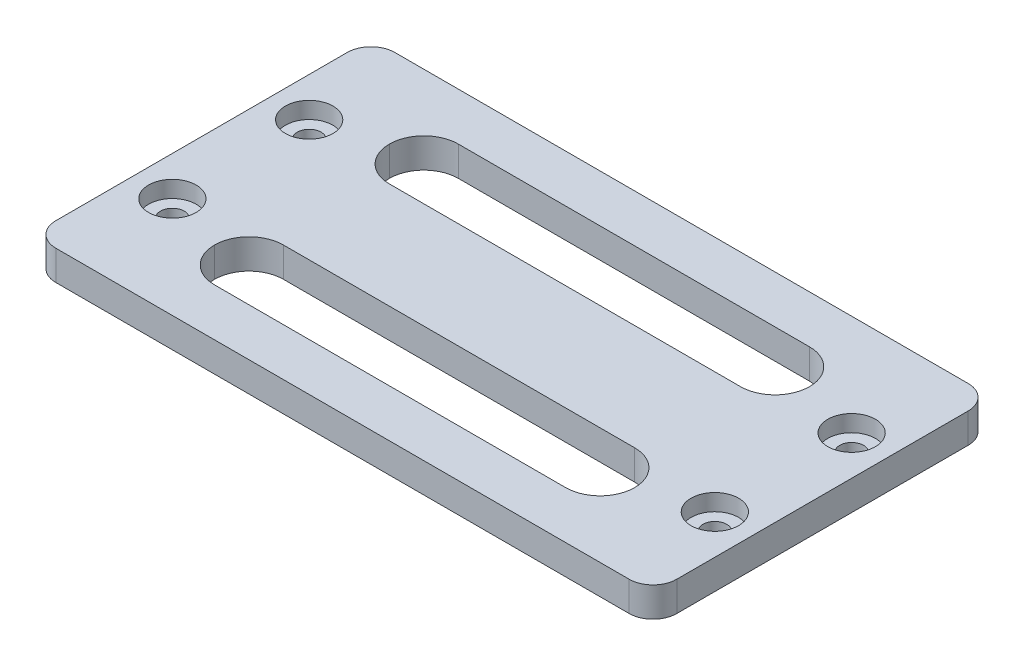
ISO-10303-21;
HEADER;
FILE_DESCRIPTION(('STEP AP214'),'2;1');
FILE_NAME('part.step','',(''),(''),'','','');
FILE_SCHEMA(('AUTOMOTIVE_DESIGN { 1 0 10303 214 1 1 1 1 }'));
ENDSEC;
DATA;
#1=APPLICATION_CONTEXT('core data for automotive mechanical design processes');
#2=APPLICATION_PROTOCOL_DEFINITION('international standard','automotive_design',2000,#1);
#3=PRODUCT_CONTEXT('',#1,'mechanical');
#4=PRODUCT('Part','Part','',(#3));
#5=PRODUCT_RELATED_PRODUCT_CATEGORY('part','',(#4));
#6=PRODUCT_DEFINITION_FORMATION('','',#4);
#7=PRODUCT_DEFINITION_CONTEXT('part definition',#1,'design');
#8=PRODUCT_DEFINITION('design','',#6,#7);
#9=PRODUCT_DEFINITION_SHAPE('','',#8);
#10=(LENGTH_UNIT() NAMED_UNIT(*) SI_UNIT(.MILLI.,.METRE.));
#11=(NAMED_UNIT(*) PLANE_ANGLE_UNIT() SI_UNIT($,.RADIAN.));
#12=(NAMED_UNIT(*) SI_UNIT($,.STERADIAN.) SOLID_ANGLE_UNIT());
#13=UNCERTAINTY_MEASURE_WITH_UNIT(LENGTH_MEASURE(1.E-05),#10,'distance_accuracy_value','');
#14=(GEOMETRIC_REPRESENTATION_CONTEXT(3) GLOBAL_UNCERTAINTY_ASSIGNED_CONTEXT((#13)) GLOBAL_UNIT_ASSIGNED_CONTEXT((#10,
#11,#12)) REPRESENTATION_CONTEXT('',''));
#15=CARTESIAN_POINT('',(0.,0.,0.));
#16=DIRECTION('',(0.,0.,1.));
#17=DIRECTION('',(1.,0.,0.));
#18=AXIS2_PLACEMENT_3D('',#15,#16,#17);
#19=CARTESIAN_POINT('',(22.8,2.5,-8.3));
#20=DIRECTION('',(0.,-1.,0.));
#21=DIRECTION('',(0.,0.,-1.));
#22=AXIS2_PLACEMENT_3D('',#19,#20,#21);
#23=CYLINDRICAL_SURFACE('',#22,1.);
#24=CARTESIAN_POINT('',(22.8,0.,-8.3));
#25=DIRECTION('',(0.,1.,0.));
#26=DIRECTION('',(0.,0.,1.));
#27=AXIS2_PLACEMENT_3D('',#24,#25,#26);
#28=CIRCLE('',#27,1.);
#29=CARTESIAN_POINT('',(22.8,0.,-7.29999999999999));
#30=VERTEX_POINT('',#29);
#31=EDGE_CURVE('E361',#30,#30,#28,.T.);
#32=ORIENTED_EDGE('',*,*,#31,.F.);
#33=EDGE_LOOP('',(#32));
#34=FACE_BOUND('',#33,.T.);
#35=CARTESIAN_POINT('',(22.8,1.1,-8.3));
#36=DIRECTION('',(0.,1.,0.));
#37=DIRECTION('',(0.,0.,1.));
#38=AXIS2_PLACEMENT_3D('',#35,#36,#37);
#39=CIRCLE('',#38,1.);
#40=CARTESIAN_POINT('',(22.8,1.1,-7.29999999999999));
#41=VERTEX_POINT('',#40);
#42=EDGE_CURVE('E41',#41,#41,#39,.T.);
#43=ORIENTED_EDGE('',*,*,#42,.T.);
#44=EDGE_LOOP('',(#43));
#45=FACE_BOUND('',#44,.T.);
#46=ADVANCED_FACE('F37',(#34,#45),#23,.F.);
#47=CARTESIAN_POINT('',(22.8,2.5,3.2));
#48=DIRECTION('',(0.,-1.,0.));
#49=DIRECTION('',(0.,0.,-1.));
#50=AXIS2_PLACEMENT_3D('',#47,#48,#49);
#51=CYLINDRICAL_SURFACE('',#50,1.);
#52=CARTESIAN_POINT('',(22.8,0.,3.2));
#53=DIRECTION('',(0.,1.,0.));
#54=DIRECTION('',(0.,0.,-1.));
#55=AXIS2_PLACEMENT_3D('',#52,#53,#54);
#56=CIRCLE('',#55,1.);
#57=CARTESIAN_POINT('',(22.8,0.,2.19999999999999));
#58=VERTEX_POINT('',#57);
#59=EDGE_CURVE('E364',#58,#58,#56,.T.);
#60=ORIENTED_EDGE('',*,*,#59,.F.);
#61=EDGE_LOOP('',(#60));
#62=FACE_BOUND('',#61,.T.);
#63=CARTESIAN_POINT('',(22.8,1.1,3.2));
#64=DIRECTION('',(0.,1.,0.));
#65=DIRECTION('',(0.,0.,1.));
#66=AXIS2_PLACEMENT_3D('',#63,#64,#65);
#67=CIRCLE('',#66,1.);
#68=CARTESIAN_POINT('',(22.8,1.1,4.2));
#69=VERTEX_POINT('',#68);
#70=EDGE_CURVE('E311',#69,#69,#67,.T.);
#71=ORIENTED_EDGE('',*,*,#70,.T.);
#72=EDGE_LOOP('',(#71));
#73=FACE_BOUND('',#72,.T.);
#74=ADVANCED_FACE('F415',(#62,#73),#51,.F.);
#75=CARTESIAN_POINT('',(-22.8,2.5,3.2));
#76=DIRECTION('',(0.,-1.,0.));
#77=DIRECTION('',(0.,0.,-1.));
#78=AXIS2_PLACEMENT_3D('',#75,#76,#77);
#79=CYLINDRICAL_SURFACE('',#78,1.);
#80=CARTESIAN_POINT('',(-22.8,0.,3.2));
#81=DIRECTION('',(0.,1.,0.));
#82=DIRECTION('',(0.,0.,1.));
#83=AXIS2_PLACEMENT_3D('',#80,#81,#82);
#84=CIRCLE('',#83,1.);
#85=CARTESIAN_POINT('',(-22.8,0.,4.2));
#86=VERTEX_POINT('',#85);
#87=EDGE_CURVE('E208',#86,#86,#84,.T.);
#88=ORIENTED_EDGE('',*,*,#87,.F.);
#89=EDGE_LOOP('',(#88));
#90=FACE_BOUND('',#89,.T.);
#91=CARTESIAN_POINT('',(-22.8,1.1,3.2));
#92=DIRECTION('',(0.,1.,0.));
#93=DIRECTION('',(0.,0.,1.));
#94=AXIS2_PLACEMENT_3D('',#91,#92,#93);
#95=CIRCLE('',#94,1.);
#96=CARTESIAN_POINT('',(-22.8,1.1,4.2));
#97=VERTEX_POINT('',#96);
#98=EDGE_CURVE('E307',#97,#97,#95,.T.);
#99=ORIENTED_EDGE('',*,*,#98,.T.);
#100=EDGE_LOOP('',(#99));
#101=FACE_BOUND('',#100,.T.);
#102=ADVANCED_FACE('F421',(#90,#101),#79,.F.);
#103=CARTESIAN_POINT('',(-22.8,2.5,-8.29999999999999));
#104=DIRECTION('',(0.,-1.,0.));
#105=DIRECTION('',(0.,0.,-1.));
#106=AXIS2_PLACEMENT_3D('',#103,#104,#105);
#107=CYLINDRICAL_SURFACE('',#106,1.);
#108=CARTESIAN_POINT('',(-22.8,0.,-8.29999999999999));
#109=DIRECTION('',(0.,1.,0.));
#110=DIRECTION('',(0.,0.,-1.));
#111=AXIS2_PLACEMENT_3D('',#108,#109,#110);
#112=CIRCLE('',#111,1.);
#113=CARTESIAN_POINT('',(-22.8,0.,-9.29999999999999));
#114=VERTEX_POINT('',#113);
#115=EDGE_CURVE('E355',#114,#114,#112,.T.);
#116=ORIENTED_EDGE('',*,*,#115,.F.);
#117=EDGE_LOOP('',(#116));
#118=FACE_BOUND('',#117,.T.);
#119=CARTESIAN_POINT('',(-22.8,1.1,-8.29999999999999));
#120=DIRECTION('',(0.,1.,0.));
#121=DIRECTION('',(0.,0.,1.));
#122=AXIS2_PLACEMENT_3D('',#119,#120,#121);
#123=CIRCLE('',#122,1.);
#124=CARTESIAN_POINT('',(-22.8,1.1,-7.29999999999999));
#125=VERTEX_POINT('',#124);
#126=EDGE_CURVE('E303',#125,#125,#123,.T.);
#127=ORIENTED_EDGE('',*,*,#126,.T.);
#128=EDGE_LOOP('',(#127));
#129=FACE_BOUND('',#128,.T.);
#130=ADVANCED_FACE('F427',(#118,#129),#107,.F.);
#131=CARTESIAN_POINT('',(0.,2.5,0.));
#132=DIRECTION('',(0.,-1.,0.));
#133=DIRECTION('',(0.,0.,-1.));
#134=AXIS2_PLACEMENT_3D('',#131,#132,#133);
#135=PLANE('',#134);
#136=CARTESIAN_POINT('',(22.8,2.5,-8.3));
#137=DIRECTION('',(0.,1.,0.));
#138=DIRECTION('',(0.,0.,1.));
#139=AXIS2_PLACEMENT_3D('',#136,#137,#138);
#140=CIRCLE('',#139,2.);
#141=CARTESIAN_POINT('',(22.8,2.5,-6.29999999999999));
#142=VERTEX_POINT('',#141);
#143=EDGE_CURVE('E327',#142,#142,#140,.T.);
#144=ORIENTED_EDGE('',*,*,#143,.F.);
#145=EDGE_LOOP('',(#144));
#146=FACE_BOUND('',#145,.T.);
#147=CARTESIAN_POINT('',(22.8,2.5,3.2));
#148=DIRECTION('',(0.,1.,0.));
#149=DIRECTION('',(0.,0.,1.));
#150=AXIS2_PLACEMENT_3D('',#147,#148,#149);
#151=CIRCLE('',#150,2.);
#152=CARTESIAN_POINT('',(22.8,2.5,5.2));
#153=VERTEX_POINT('',#152);
#154=EDGE_CURVE('E320',#153,#153,#151,.T.);
#155=ORIENTED_EDGE('',*,*,#154,.F.);
#156=EDGE_LOOP('',(#155));
#157=FACE_BOUND('',#156,.T.);
#158=CARTESIAN_POINT('',(-22.8,2.5,3.2));
#159=DIRECTION('',(0.,1.,0.));
#160=DIRECTION('',(0.,0.,1.));
#161=AXIS2_PLACEMENT_3D('',#158,#159,#160);
#162=CIRCLE('',#161,2.);
#163=CARTESIAN_POINT('',(-22.8,2.5,5.2));
#164=VERTEX_POINT('',#163);
#165=EDGE_CURVE('E313',#164,#164,#162,.T.);
#166=ORIENTED_EDGE('',*,*,#165,.F.);
#167=EDGE_LOOP('',(#166));
#168=FACE_BOUND('',#167,.T.);
#169=CARTESIAN_POINT('',(-22.8,2.5,-8.29999999999999));
#170=DIRECTION('',(0.,1.,0.));
#171=DIRECTION('',(0.,0.,1.));
#172=AXIS2_PLACEMENT_3D('',#169,#170,#171);
#173=CIRCLE('',#172,2.);
#174=CARTESIAN_POINT('',(-22.8,2.5,-6.29999999999999));
#175=VERTEX_POINT('',#174);
#176=EDGE_CURVE('E309',#175,#175,#173,.T.);
#177=ORIENTED_EDGE('',*,*,#176,.F.);
#178=EDGE_LOOP('',(#177));
#179=FACE_BOUND('',#178,.T.);
#180=DIRECTION('',(-1.,0.,0.));
#181=VECTOR('',#180,1.);
#182=CARTESIAN_POINT('',(-17.6603184164153,2.5,-12.8));
#183=LINE('',#182,#181);
#184=CARTESIAN_POINT('',(14.7603184164153,2.5,-12.8));
#185=VERTEX_POINT('',#184);
#186=CARTESIAN_POINT('',(-14.7603184164153,2.5,-12.8));
#187=VERTEX_POINT('',#186);
#188=EDGE_CURVE('E348',#185,#187,#183,.T.);
#189=ORIENTED_EDGE('',*,*,#188,.F.);
#190=CARTESIAN_POINT('',(14.7603184164153,2.5,-9.90000000000001));
#191=DIRECTION('',(0.,-1.,0.));
#192=DIRECTION('',(0.,0.,-1.));
#193=AXIS2_PLACEMENT_3D('',#190,#191,#192);
#194=CIRCLE('',#193,2.9);
#195=CARTESIAN_POINT('',(17.6603184164153,2.5,-9.90000000000001));
#196=VERTEX_POINT('',#195);
#197=EDGE_CURVE('E268',#185,#196,#194,.T.);
#198=ORIENTED_EDGE('',*,*,#197,.T.);
#199=CARTESIAN_POINT('',(14.7603184164153,2.5,-9.90000000000001));
#200=DIRECTION('',(0.,-1.,0.));
#201=DIRECTION('',(0.,0.,-1.));
#202=AXIS2_PLACEMENT_3D('',#199,#200,#201);
#203=CIRCLE('',#202,2.9);
#204=CARTESIAN_POINT('',(14.7603184164153,2.5,-7.00000000000001));
#205=VERTEX_POINT('',#204);
#206=EDGE_CURVE('E264',#196,#205,#203,.T.);
#207=ORIENTED_EDGE('',*,*,#206,.T.);
#208=DIRECTION('',(1.,0.,0.));
#209=VECTOR('',#208,1.);
#210=CARTESIAN_POINT('',(-17.6603184164153,2.5,-7.00000000000001));
#211=LINE('',#210,#209);
#212=CARTESIAN_POINT('',(-14.7603184164153,2.5,-7.00000000000001));
#213=VERTEX_POINT('',#212);
#214=EDGE_CURVE('E351',#213,#205,#211,.T.);
#215=ORIENTED_EDGE('',*,*,#214,.F.);
#216=CARTESIAN_POINT('',(-14.7603184164153,2.5,-9.90000000000001));
#217=DIRECTION('',(0.,-1.,0.));
#218=DIRECTION('',(0.,0.,-1.));
#219=AXIS2_PLACEMENT_3D('',#216,#217,#218);
#220=CIRCLE('',#219,2.9);
#221=CARTESIAN_POINT('',(-17.6603184164153,2.5,-9.90000000000001));
#222=VERTEX_POINT('',#221);
#223=EDGE_CURVE('E53',#213,#222,#220,.T.);
#224=ORIENTED_EDGE('',*,*,#223,.T.);
#225=CARTESIAN_POINT('',(-14.7603184164153,2.5,-9.90000000000001));
#226=DIRECTION('',(0.,-1.,0.));
#227=DIRECTION('',(0.,0.,-1.));
#228=AXIS2_PLACEMENT_3D('',#225,#226,#227);
#229=CIRCLE('',#228,2.9);
#230=EDGE_CURVE('E11',#222,#187,#229,.T.);
#231=ORIENTED_EDGE('',*,*,#230,.T.);
#232=EDGE_LOOP('',(#189,#198,#207,#215,#224,#231));
#233=FACE_BOUND('',#232,.T.);
#234=DIRECTION('',(0.,0.,-1.));
#235=VECTOR('',#234,1.);
#236=CARTESIAN_POINT('',(26.1,2.5,11.7));
#237=LINE('',#236,#235);
#238=CARTESIAN_POINT('',(26.1,2.5,9.7));
#239=VERTEX_POINT('',#238);
#240=CARTESIAN_POINT('',(26.1,2.5,-14.8));
#241=VERTEX_POINT('',#240);
#242=EDGE_CURVE('E214',#239,#241,#237,.T.);
#243=ORIENTED_EDGE('',*,*,#242,.T.);
#244=CARTESIAN_POINT('',(24.1,2.5,-14.8));
#245=DIRECTION('',(0.,-1.,0.));
#246=DIRECTION('',(0.,0.,-1.));
#247=AXIS2_PLACEMENT_3D('',#244,#245,#246);
#248=CIRCLE('',#247,2.);
#249=CARTESIAN_POINT('',(24.1,2.5,-16.8));
#250=VERTEX_POINT('',#249);
#251=EDGE_CURVE('E230',#241,#250,#248,.F.);
#252=ORIENTED_EDGE('',*,*,#251,.T.);
#253=DIRECTION('',(-1.,0.,0.));
#254=VECTOR('',#253,1.);
#255=CARTESIAN_POINT('',(-26.1,2.5,-16.8));
#256=LINE('',#255,#254);
#257=CARTESIAN_POINT('',(-24.1,2.5,-16.8));
#258=VERTEX_POINT('',#257);
#259=EDGE_CURVE('E195',#250,#258,#256,.T.);
#260=ORIENTED_EDGE('',*,*,#259,.T.);
#261=CARTESIAN_POINT('',(-24.1,2.5,-14.8));
#262=DIRECTION('',(0.,-1.,0.));
#263=DIRECTION('',(0.,0.,-1.));
#264=AXIS2_PLACEMENT_3D('',#261,#262,#263);
#265=CIRCLE('',#264,2.);
#266=CARTESIAN_POINT('',(-26.1,2.5,-14.8));
#267=VERTEX_POINT('',#266);
#268=EDGE_CURVE('E224',#258,#267,#265,.F.);
#269=ORIENTED_EDGE('',*,*,#268,.T.);
#270=DIRECTION('',(0.,0.,1.));
#271=VECTOR('',#270,1.);
#272=CARTESIAN_POINT('',(-26.1,2.5,11.7));
#273=LINE('',#272,#271);
#274=CARTESIAN_POINT('',(-26.1,2.5,9.7));
#275=VERTEX_POINT('',#274);
#276=EDGE_CURVE('E372',#267,#275,#273,.T.);
#277=ORIENTED_EDGE('',*,*,#276,.T.);
#278=CARTESIAN_POINT('',(-24.1,2.5,9.7));
#279=DIRECTION('',(0.,-1.,0.));
#280=DIRECTION('',(0.,0.,-1.));
#281=AXIS2_PLACEMENT_3D('',#278,#279,#280);
#282=CIRCLE('',#281,2.);
#283=CARTESIAN_POINT('',(-24.1,2.5,11.7));
#284=VERTEX_POINT('',#283);
#285=EDGE_CURVE('E226',#275,#284,#282,.F.);
#286=ORIENTED_EDGE('',*,*,#285,.T.);
#287=DIRECTION('',(1.,0.,0.));
#288=VECTOR('',#287,1.);
#289=CARTESIAN_POINT('',(-26.1,2.5,11.7));
#290=LINE('',#289,#288);
#291=CARTESIAN_POINT('',(24.1,2.5,11.7));
#292=VERTEX_POINT('',#291);
#293=EDGE_CURVE('E215',#284,#292,#290,.T.);
#294=ORIENTED_EDGE('',*,*,#293,.T.);
#295=CARTESIAN_POINT('',(24.1,2.5,9.7));
#296=DIRECTION('',(0.,-1.,0.));
#297=DIRECTION('',(0.,0.,-1.));
#298=AXIS2_PLACEMENT_3D('',#295,#296,#297);
#299=CIRCLE('',#298,2.);
#300=EDGE_CURVE('E228',#292,#239,#299,.F.);
#301=ORIENTED_EDGE('',*,*,#300,.T.);
#302=EDGE_LOOP('',(#243,#252,#260,#269,#277,#286,#294,#301));
#303=FACE_BOUND('',#302,.T.);
#304=CARTESIAN_POINT('',(-14.7603184164153,2.5,4.80000000000001));
#305=DIRECTION('',(0.,-1.,0.));
#306=DIRECTION('',(0.,0.,-1.));
#307=AXIS2_PLACEMENT_3D('',#304,#305,#306);
#308=CIRCLE('',#307,2.9);
#309=CARTESIAN_POINT('',(-14.7603184164153,2.5,7.70000000000001));
#310=VERTEX_POINT('',#309);
#311=CARTESIAN_POINT('',(-17.6603184164153,2.5,4.80000000000001));
#312=VERTEX_POINT('',#311);
#313=EDGE_CURVE('E280',#310,#312,#308,.T.);
#314=ORIENTED_EDGE('',*,*,#313,.T.);
#315=CARTESIAN_POINT('',(-14.7603184164153,2.5,4.80000000000001));
#316=DIRECTION('',(0.,-1.,0.));
#317=DIRECTION('',(0.,0.,-1.));
#318=AXIS2_PLACEMENT_3D('',#315,#316,#317);
#319=CIRCLE('',#318,2.9);
#320=CARTESIAN_POINT('',(-14.7603184164153,2.5,1.90000000000001));
#321=VERTEX_POINT('',#320);
#322=EDGE_CURVE('E284',#312,#321,#319,.T.);
#323=ORIENTED_EDGE('',*,*,#322,.T.);
#324=DIRECTION('',(-1.,0.,0.));
#325=VECTOR('',#324,1.);
#326=CARTESIAN_POINT('',(-17.6603184164153,2.5,1.90000000000001));
#327=LINE('',#326,#325);
#328=CARTESIAN_POINT('',(14.7603184164153,2.5,1.90000000000001));
#329=VERTEX_POINT('',#328);
#330=EDGE_CURVE('E339',#329,#321,#327,.T.);
#331=ORIENTED_EDGE('',*,*,#330,.F.);
#332=CARTESIAN_POINT('',(14.7603184164153,2.5,4.80000000000001));
#333=DIRECTION('',(0.,-1.,0.));
#334=DIRECTION('',(0.,0.,-1.));
#335=AXIS2_PLACEMENT_3D('',#332,#333,#334);
#336=CIRCLE('',#335,2.9);
#337=CARTESIAN_POINT('',(17.6603184164153,2.5,4.80000000000001));
#338=VERTEX_POINT('',#337);
#339=EDGE_CURVE('E276',#329,#338,#336,.T.);
#340=ORIENTED_EDGE('',*,*,#339,.T.);
#341=CARTESIAN_POINT('',(14.7603184164153,2.5,4.80000000000001));
#342=DIRECTION('',(0.,-1.,0.));
#343=DIRECTION('',(0.,0.,-1.));
#344=AXIS2_PLACEMENT_3D('',#341,#342,#343);
#345=CIRCLE('',#344,2.9);
#346=CARTESIAN_POINT('',(14.7603184164153,2.5,7.70000000000001));
#347=VERTEX_POINT('',#346);
#348=EDGE_CURVE('E272',#338,#347,#345,.T.);
#349=ORIENTED_EDGE('',*,*,#348,.T.);
#350=DIRECTION('',(1.,0.,0.));
#351=VECTOR('',#350,1.);
#352=CARTESIAN_POINT('',(-17.6603184164153,2.5,7.70000000000001));
#353=LINE('',#352,#351);
#354=EDGE_CURVE('E336',#310,#347,#353,.T.);
#355=ORIENTED_EDGE('',*,*,#354,.F.);
#356=EDGE_LOOP('',(#314,#323,#331,#340,#349,#355));
#357=FACE_BOUND('',#356,.T.);
#358=ADVANCED_FACE('F378',(#146,#157,#168,#179,#233,#303,#357),#135,.F.);
#359=CARTESIAN_POINT('',(0.,0.,0.));
#360=DIRECTION('',(0.,-1.,0.));
#361=DIRECTION('',(0.,0.,-1.));
#362=AXIS2_PLACEMENT_3D('',#359,#360,#361);
#363=PLANE('',#362);
#364=DIRECTION('',(-1.,0.,0.));
#365=VECTOR('',#364,1.);
#366=CARTESIAN_POINT('',(-17.6603184164153,0.,-12.8));
#367=LINE('',#366,#365);
#368=CARTESIAN_POINT('',(14.7603184164153,0.,-12.8));
#369=VERTEX_POINT('',#368);
#370=CARTESIAN_POINT('',(-14.7603184164153,0.,-12.8));
#371=VERTEX_POINT('',#370);
#372=EDGE_CURVE('E343',#369,#371,#367,.T.);
#373=ORIENTED_EDGE('',*,*,#372,.T.);
#374=CARTESIAN_POINT('',(-14.7603184164153,0.,-9.90000000000001));
#375=DIRECTION('',(0.,-1.,0.));
#376=DIRECTION('',(0.,0.,-1.));
#377=AXIS2_PLACEMENT_3D('',#374,#375,#376);
#378=CIRCLE('',#377,2.9);
#379=CARTESIAN_POINT('',(-17.6603184164153,0.,-9.90000000000001));
#380=VERTEX_POINT('',#379);
#381=EDGE_CURVE('E46',#371,#380,#378,.F.);
#382=ORIENTED_EDGE('',*,*,#381,.T.);
#383=CARTESIAN_POINT('',(-14.7603184164153,0.,-9.90000000000001));
#384=DIRECTION('',(0.,-1.,0.));
#385=DIRECTION('',(0.,0.,-1.));
#386=AXIS2_PLACEMENT_3D('',#383,#384,#385);
#387=CIRCLE('',#386,2.9);
#388=CARTESIAN_POINT('',(-14.7603184164153,0.,-7.00000000000001));
#389=VERTEX_POINT('',#388);
#390=EDGE_CURVE('E286',#380,#389,#387,.F.);
#391=ORIENTED_EDGE('',*,*,#390,.T.);
#392=DIRECTION('',(1.,0.,0.));
#393=VECTOR('',#392,1.);
#394=CARTESIAN_POINT('',(-17.6603184164153,0.,-7.00000000000001));
#395=LINE('',#394,#393);
#396=CARTESIAN_POINT('',(14.7603184164153,0.,-7.00000000000001));
#397=VERTEX_POINT('',#396);
#398=EDGE_CURVE('E352',#389,#397,#395,.T.);
#399=ORIENTED_EDGE('',*,*,#398,.T.);
#400=CARTESIAN_POINT('',(14.7603184164153,0.,-9.90000000000001));
#401=DIRECTION('',(0.,-1.,0.));
#402=DIRECTION('',(0.,0.,-1.));
#403=AXIS2_PLACEMENT_3D('',#400,#401,#402);
#404=CIRCLE('',#403,2.9);
#405=CARTESIAN_POINT('',(17.6603184164153,0.,-9.90000000000001));
#406=VERTEX_POINT('',#405);
#407=EDGE_CURVE('E262',#397,#406,#404,.F.);
#408=ORIENTED_EDGE('',*,*,#407,.T.);
#409=CARTESIAN_POINT('',(14.7603184164153,0.,-9.90000000000001));
#410=DIRECTION('',(0.,-1.,0.));
#411=DIRECTION('',(0.,0.,-1.));
#412=AXIS2_PLACEMENT_3D('',#409,#410,#411);
#413=CIRCLE('',#412,2.9);
#414=EDGE_CURVE('E266',#406,#369,#413,.F.);
#415=ORIENTED_EDGE('',*,*,#414,.T.);
#416=EDGE_LOOP('',(#373,#382,#391,#399,#408,#415));
#417=FACE_BOUND('',#416,.T.);
#418=ORIENTED_EDGE('',*,*,#31,.T.);
#419=EDGE_LOOP('',(#418));
#420=FACE_BOUND('',#419,.T.);
#421=ORIENTED_EDGE('',*,*,#87,.T.);
#422=EDGE_LOOP('',(#421));
#423=FACE_BOUND('',#422,.T.);
#424=DIRECTION('',(-1.,0.,0.));
#425=VECTOR('',#424,1.);
#426=CARTESIAN_POINT('',(-26.1,0.,-16.8));
#427=LINE('',#426,#425);
#428=CARTESIAN_POINT('',(24.1,0.,-16.8));
#429=VERTEX_POINT('',#428);
#430=CARTESIAN_POINT('',(-24.1,0.,-16.8));
#431=VERTEX_POINT('',#430);
#432=EDGE_CURVE('E192',#429,#431,#427,.T.);
#433=ORIENTED_EDGE('',*,*,#432,.F.);
#434=CARTESIAN_POINT('',(24.1,0.,-14.8));
#435=DIRECTION('',(0.,-1.,0.));
#436=DIRECTION('',(0.,0.,-1.));
#437=AXIS2_PLACEMENT_3D('',#434,#435,#436);
#438=CIRCLE('',#437,2.);
#439=CARTESIAN_POINT('',(26.1,0.,-14.8));
#440=VERTEX_POINT('',#439);
#441=EDGE_CURVE('E175',#429,#440,#438,.T.);
#442=ORIENTED_EDGE('',*,*,#441,.T.);
#443=DIRECTION('',(0.,0.,-1.));
#444=VECTOR('',#443,1.);
#445=CARTESIAN_POINT('',(26.1,0.,11.7));
#446=LINE('',#445,#444);
#447=CARTESIAN_POINT('',(26.1,0.,9.7));
#448=VERTEX_POINT('',#447);
#449=EDGE_CURVE('E203',#448,#440,#446,.T.);
#450=ORIENTED_EDGE('',*,*,#449,.F.);
#451=CARTESIAN_POINT('',(24.1,0.,9.7));
#452=DIRECTION('',(0.,-1.,0.));
#453=DIRECTION('',(0.,0.,-1.));
#454=AXIS2_PLACEMENT_3D('',#451,#452,#453);
#455=CIRCLE('',#454,2.);
#456=CARTESIAN_POINT('',(24.1,0.,11.7));
#457=VERTEX_POINT('',#456);
#458=EDGE_CURVE('E186',#448,#457,#455,.T.);
#459=ORIENTED_EDGE('',*,*,#458,.T.);
#460=DIRECTION('',(1.,0.,0.));
#461=VECTOR('',#460,1.);
#462=CARTESIAN_POINT('',(-26.1,0.,11.7));
#463=LINE('',#462,#461);
#464=CARTESIAN_POINT('',(-24.1,0.,11.7));
#465=VERTEX_POINT('',#464);
#466=EDGE_CURVE('E206',#465,#457,#463,.T.);
#467=ORIENTED_EDGE('',*,*,#466,.F.);
#468=CARTESIAN_POINT('',(-24.1,0.,9.7));
#469=DIRECTION('',(0.,-1.,0.));
#470=DIRECTION('',(0.,0.,-1.));
#471=AXIS2_PLACEMENT_3D('',#468,#469,#470);
#472=CIRCLE('',#471,2.);
#473=CARTESIAN_POINT('',(-26.1,0.,9.7));
#474=VERTEX_POINT('',#473);
#475=EDGE_CURVE('E218',#465,#474,#472,.T.);
#476=ORIENTED_EDGE('',*,*,#475,.T.);
#477=DIRECTION('',(0.,0.,1.));
#478=VECTOR('',#477,1.);
#479=CARTESIAN_POINT('',(-26.1,0.,11.7));
#480=LINE('',#479,#478);
#481=CARTESIAN_POINT('',(-26.1,0.,-14.8));
#482=VERTEX_POINT('',#481);
#483=EDGE_CURVE('E202',#482,#474,#480,.T.);
#484=ORIENTED_EDGE('',*,*,#483,.F.);
#485=CARTESIAN_POINT('',(-24.1,0.,-14.8));
#486=DIRECTION('',(0.,-1.,0.));
#487=DIRECTION('',(0.,0.,-1.));
#488=AXIS2_PLACEMENT_3D('',#485,#486,#487);
#489=CIRCLE('',#488,2.);
#490=EDGE_CURVE('E196',#482,#431,#489,.T.);
#491=ORIENTED_EDGE('',*,*,#490,.T.);
#492=EDGE_LOOP('',(#433,#442,#450,#459,#467,#476,#484,#491));
#493=FACE_BOUND('',#492,.T.);
#494=ORIENTED_EDGE('',*,*,#59,.T.);
#495=EDGE_LOOP('',(#494));
#496=FACE_BOUND('',#495,.T.);
#497=ORIENTED_EDGE('',*,*,#115,.T.);
#498=EDGE_LOOP('',(#497));
#499=FACE_BOUND('',#498,.T.);
#500=CARTESIAN_POINT('',(14.7603184164153,0.,4.80000000000001));
#501=DIRECTION('',(0.,-1.,0.));
#502=DIRECTION('',(0.,0.,-1.));
#503=AXIS2_PLACEMENT_3D('',#500,#501,#502);
#504=CIRCLE('',#503,2.9);
#505=CARTESIAN_POINT('',(14.7603184164153,0.,7.70000000000001));
#506=VERTEX_POINT('',#505);
#507=CARTESIAN_POINT('',(17.6603184164153,0.,4.80000000000001));
#508=VERTEX_POINT('',#507);
#509=EDGE_CURVE('E270',#506,#508,#504,.F.);
#510=ORIENTED_EDGE('',*,*,#509,.T.);
#511=CARTESIAN_POINT('',(14.7603184164153,0.,4.80000000000001));
#512=DIRECTION('',(0.,-1.,0.));
#513=DIRECTION('',(0.,0.,-1.));
#514=AXIS2_PLACEMENT_3D('',#511,#512,#513);
#515=CIRCLE('',#514,2.9);
#516=CARTESIAN_POINT('',(14.7603184164153,0.,1.90000000000001));
#517=VERTEX_POINT('',#516);
#518=EDGE_CURVE('E274',#508,#517,#515,.F.);
#519=ORIENTED_EDGE('',*,*,#518,.T.);
#520=DIRECTION('',(-1.,0.,0.));
#521=VECTOR('',#520,1.);
#522=CARTESIAN_POINT('',(-17.6603184164153,0.,1.90000000000001));
#523=LINE('',#522,#521);
#524=CARTESIAN_POINT('',(-14.7603184164153,0.,1.90000000000001));
#525=VERTEX_POINT('',#524);
#526=EDGE_CURVE('E340',#517,#525,#523,.T.);
#527=ORIENTED_EDGE('',*,*,#526,.T.);
#528=CARTESIAN_POINT('',(-14.7603184164153,0.,4.80000000000001));
#529=DIRECTION('',(0.,-1.,0.));
#530=DIRECTION('',(0.,0.,-1.));
#531=AXIS2_PLACEMENT_3D('',#528,#529,#530);
#532=CIRCLE('',#531,2.9);
#533=CARTESIAN_POINT('',(-17.6603184164153,0.,4.80000000000001));
#534=VERTEX_POINT('',#533);
#535=EDGE_CURVE('E282',#525,#534,#532,.F.);
#536=ORIENTED_EDGE('',*,*,#535,.T.);
#537=CARTESIAN_POINT('',(-14.7603184164153,0.,4.80000000000001));
#538=DIRECTION('',(0.,-1.,0.));
#539=DIRECTION('',(0.,0.,-1.));
#540=AXIS2_PLACEMENT_3D('',#537,#538,#539);
#541=CIRCLE('',#540,2.9);
#542=CARTESIAN_POINT('',(-14.7603184164153,0.,7.70000000000001));
#543=VERTEX_POINT('',#542);
#544=EDGE_CURVE('E278',#534,#543,#541,.F.);
#545=ORIENTED_EDGE('',*,*,#544,.T.);
#546=DIRECTION('',(1.,0.,0.));
#547=VECTOR('',#546,1.);
#548=CARTESIAN_POINT('',(-17.6603184164153,0.,7.70000000000001));
#549=LINE('',#548,#547);
#550=EDGE_CURVE('E293',#543,#506,#549,.T.);
#551=ORIENTED_EDGE('',*,*,#550,.T.);
#552=EDGE_LOOP('',(#510,#519,#527,#536,#545,#551));
#553=FACE_BOUND('',#552,.T.);
#554=ADVANCED_FACE('F199',(#417,#420,#423,#493,#496,#499,#553),#363,.T.);
#555=CARTESIAN_POINT('',(26.1,2.5,11.7));
#556=DIRECTION('',(-1.,0.,0.));
#557=DIRECTION('',(0.,0.,1.));
#558=AXIS2_PLACEMENT_3D('',#555,#556,#557);
#559=PLANE('',#558);
#560=ORIENTED_EDGE('',*,*,#449,.T.);
#561=DIRECTION('',(0.,-1.,0.));
#562=VECTOR('',#561,1.);
#563=CARTESIAN_POINT('',(26.1,2.5,-14.8));
#564=LINE('',#563,#562);
#565=EDGE_CURVE('E180',#440,#241,#564,.F.);
#566=ORIENTED_EDGE('',*,*,#565,.T.);
#567=ORIENTED_EDGE('',*,*,#242,.F.);
#568=DIRECTION('',(0.,-1.,0.));
#569=VECTOR('',#568,1.);
#570=CARTESIAN_POINT('',(26.1,2.5,9.7));
#571=LINE('',#570,#569);
#572=EDGE_CURVE('E185',#239,#448,#571,.T.);
#573=ORIENTED_EDGE('',*,*,#572,.T.);
#574=EDGE_LOOP('',(#560,#566,#567,#573));
#575=FACE_BOUND('',#574,.T.);
#576=ADVANCED_FACE('F389',(#575),#559,.F.);
#577=CARTESIAN_POINT('',(-26.1,2.5,-16.8));
#578=DIRECTION('',(0.,0.,1.));
#579=DIRECTION('',(1.,0.,0.));
#580=AXIS2_PLACEMENT_3D('',#577,#578,#579);
#581=PLANE('',#580);
#582=ORIENTED_EDGE('',*,*,#259,.F.);
#583=DIRECTION('',(0.,-1.,0.));
#584=VECTOR('',#583,1.);
#585=CARTESIAN_POINT('',(24.1,2.5,-16.8));
#586=LINE('',#585,#584);
#587=EDGE_CURVE('E179',#250,#429,#586,.T.);
#588=ORIENTED_EDGE('',*,*,#587,.T.);
#589=ORIENTED_EDGE('',*,*,#432,.T.);
#590=DIRECTION('',(0.,-1.,0.));
#591=VECTOR('',#590,1.);
#592=CARTESIAN_POINT('',(-24.1,2.5,-16.8));
#593=LINE('',#592,#591);
#594=EDGE_CURVE('E197',#431,#258,#593,.F.);
#595=ORIENTED_EDGE('',*,*,#594,.T.);
#596=EDGE_LOOP('',(#582,#588,#589,#595));
#597=FACE_BOUND('',#596,.T.);
#598=ADVANCED_FACE('F191',(#597),#581,.F.);
#599=CARTESIAN_POINT('',(-26.1,2.5,11.7));
#600=DIRECTION('',(1.,0.,0.));
#601=DIRECTION('',(0.,0.,-1.));
#602=AXIS2_PLACEMENT_3D('',#599,#600,#601);
#603=PLANE('',#602);
#604=ORIENTED_EDGE('',*,*,#483,.T.);
#605=DIRECTION('',(0.,-1.,0.));
#606=VECTOR('',#605,1.);
#607=CARTESIAN_POINT('',(-26.1,2.5,9.7));
#608=LINE('',#607,#606);
#609=EDGE_CURVE('E240',#474,#275,#608,.F.);
#610=ORIENTED_EDGE('',*,*,#609,.T.);
#611=ORIENTED_EDGE('',*,*,#276,.F.);
#612=DIRECTION('',(0.,-1.,0.));
#613=VECTOR('',#612,1.);
#614=CARTESIAN_POINT('',(-26.1,2.5,-14.8));
#615=LINE('',#614,#613);
#616=EDGE_CURVE('E237',#267,#482,#615,.T.);
#617=ORIENTED_EDGE('',*,*,#616,.T.);
#618=EDGE_LOOP('',(#604,#610,#611,#617));
#619=FACE_BOUND('',#618,.T.);
#620=ADVANCED_FACE('F396',(#619),#603,.F.);
#621=CARTESIAN_POINT('',(-26.1,2.5,11.7));
#622=DIRECTION('',(0.,0.,-1.));
#623=DIRECTION('',(-1.,0.,0.));
#624=AXIS2_PLACEMENT_3D('',#621,#622,#623);
#625=PLANE('',#624);
#626=ORIENTED_EDGE('',*,*,#466,.T.);
#627=DIRECTION('',(0.,-1.,0.));
#628=VECTOR('',#627,1.);
#629=CARTESIAN_POINT('',(24.1,2.5,11.7));
#630=LINE('',#629,#628);
#631=EDGE_CURVE('E235',#457,#292,#630,.F.);
#632=ORIENTED_EDGE('',*,*,#631,.T.);
#633=ORIENTED_EDGE('',*,*,#293,.F.);
#634=DIRECTION('',(0.,-1.,0.));
#635=VECTOR('',#634,1.);
#636=CARTESIAN_POINT('',(-24.1,2.5,11.7));
#637=LINE('',#636,#635);
#638=EDGE_CURVE('E232',#284,#465,#637,.T.);
#639=ORIENTED_EDGE('',*,*,#638,.T.);
#640=EDGE_LOOP('',(#626,#632,#633,#639));
#641=FACE_BOUND('',#640,.T.);
#642=ADVANCED_FACE('F391',(#641),#625,.F.);
#643=CARTESIAN_POINT('',(-17.6603184164153,2.5,-12.8));
#644=DIRECTION('',(0.,0.,1.));
#645=DIRECTION('',(1.,0.,0.));
#646=AXIS2_PLACEMENT_3D('',#643,#644,#645);
#647=PLANE('',#646);
#648=ORIENTED_EDGE('',*,*,#372,.F.);
#649=DIRECTION('',(0.,-1.,0.));
#650=VECTOR('',#649,1.);
#651=CARTESIAN_POINT('',(14.7603184164153,2.5,-12.8));
#652=LINE('',#651,#650);
#653=EDGE_CURVE('E250',#369,#185,#652,.F.);
#654=ORIENTED_EDGE('',*,*,#653,.T.);
#655=ORIENTED_EDGE('',*,*,#188,.T.);
#656=DIRECTION('',(0.,-1.,0.));
#657=VECTOR('',#656,1.);
#658=CARTESIAN_POINT('',(-14.7603184164153,0.,-12.8));
#659=LINE('',#658,#657);
#660=EDGE_CURVE('E248',#187,#371,#659,.T.);
#661=ORIENTED_EDGE('',*,*,#660,.T.);
#662=EDGE_LOOP('',(#648,#654,#655,#661));
#663=FACE_BOUND('',#662,.T.);
#664=ADVANCED_FACE('F440',(#663),#647,.T.);
#665=CARTESIAN_POINT('',(-17.6603184164153,2.5,-7.00000000000001));
#666=DIRECTION('',(0.,0.,-1.));
#667=DIRECTION('',(-1.,0.,0.));
#668=AXIS2_PLACEMENT_3D('',#665,#666,#667);
#669=PLANE('',#668);
#670=ORIENTED_EDGE('',*,*,#214,.T.);
#671=DIRECTION('',(0.,-1.,0.));
#672=VECTOR('',#671,1.);
#673=CARTESIAN_POINT('',(14.7603184164153,0.,-7.00000000000001));
#674=LINE('',#673,#672);
#675=EDGE_CURVE('E245',#205,#397,#674,.T.);
#676=ORIENTED_EDGE('',*,*,#675,.T.);
#677=ORIENTED_EDGE('',*,*,#398,.F.);
#678=DIRECTION('',(0.,-1.,0.));
#679=VECTOR('',#678,1.);
#680=CARTESIAN_POINT('',(-14.7603184164153,2.5,-7.00000000000001));
#681=LINE('',#680,#679);
#682=EDGE_CURVE('E242',#389,#213,#681,.F.);
#683=ORIENTED_EDGE('',*,*,#682,.T.);
#684=EDGE_LOOP('',(#670,#676,#677,#683));
#685=FACE_BOUND('',#684,.T.);
#686=ADVANCED_FACE('F482',(#685),#669,.T.);
#687=CARTESIAN_POINT('',(-17.6603184164153,2.5,7.70000000000001));
#688=DIRECTION('',(0.,0.,-1.));
#689=DIRECTION('',(-1.,0.,0.));
#690=AXIS2_PLACEMENT_3D('',#687,#688,#689);
#691=PLANE('',#690);
#692=ORIENTED_EDGE('',*,*,#354,.T.);
#693=DIRECTION('',(0.,-1.,0.));
#694=VECTOR('',#693,1.);
#695=CARTESIAN_POINT('',(14.7603184164153,0.,7.70000000000001));
#696=LINE('',#695,#694);
#697=EDGE_CURVE('E255',#347,#506,#696,.T.);
#698=ORIENTED_EDGE('',*,*,#697,.T.);
#699=ORIENTED_EDGE('',*,*,#550,.F.);
#700=DIRECTION('',(0.,-1.,0.));
#701=VECTOR('',#700,1.);
#702=CARTESIAN_POINT('',(-14.7603184164153,2.5,7.70000000000001));
#703=LINE('',#702,#701);
#704=EDGE_CURVE('E252',#543,#310,#703,.F.);
#705=ORIENTED_EDGE('',*,*,#704,.T.);
#706=EDGE_LOOP('',(#692,#698,#699,#705));
#707=FACE_BOUND('',#706,.T.);
#708=ADVANCED_FACE('F492',(#707),#691,.T.);
#709=CARTESIAN_POINT('',(-17.6603184164153,2.5,1.90000000000001));
#710=DIRECTION('',(0.,0.,1.));
#711=DIRECTION('',(1.,0.,0.));
#712=AXIS2_PLACEMENT_3D('',#709,#710,#711);
#713=PLANE('',#712);
#714=ORIENTED_EDGE('',*,*,#526,.F.);
#715=DIRECTION('',(0.,-1.,0.));
#716=VECTOR('',#715,1.);
#717=CARTESIAN_POINT('',(14.7603184164153,2.5,1.90000000000001));
#718=LINE('',#717,#716);
#719=EDGE_CURVE('E260',#517,#329,#718,.F.);
#720=ORIENTED_EDGE('',*,*,#719,.T.);
#721=ORIENTED_EDGE('',*,*,#330,.T.);
#722=DIRECTION('',(0.,-1.,0.));
#723=VECTOR('',#722,1.);
#724=CARTESIAN_POINT('',(-14.7603184164153,0.,1.90000000000001));
#725=LINE('',#724,#723);
#726=EDGE_CURVE('E258',#321,#525,#725,.T.);
#727=ORIENTED_EDGE('',*,*,#726,.T.);
#728=EDGE_LOOP('',(#714,#720,#721,#727));
#729=FACE_BOUND('',#728,.T.);
#730=ADVANCED_FACE('F449',(#729),#713,.T.);
#731=CARTESIAN_POINT('',(24.1,2.5,-14.8));
#732=DIRECTION('',(0.,-1.,0.));
#733=DIRECTION('',(0.,0.,-1.));
#734=AXIS2_PLACEMENT_3D('',#731,#732,#733);
#735=CYLINDRICAL_SURFACE('',#734,2.);
#736=ORIENTED_EDGE('',*,*,#251,.F.);
#737=ORIENTED_EDGE('',*,*,#565,.F.);
#738=ORIENTED_EDGE('',*,*,#441,.F.);
#739=ORIENTED_EDGE('',*,*,#587,.F.);
#740=EDGE_LOOP('',(#736,#737,#738,#739));
#741=FACE_BOUND('',#740,.T.);
#742=ADVANCED_FACE('F178',(#741),#735,.T.);
#743=CARTESIAN_POINT('',(24.1,2.5,9.7));
#744=DIRECTION('',(0.,-1.,0.));
#745=DIRECTION('',(0.,0.,-1.));
#746=AXIS2_PLACEMENT_3D('',#743,#744,#745);
#747=CYLINDRICAL_SURFACE('',#746,2.);
#748=ORIENTED_EDGE('',*,*,#300,.F.);
#749=ORIENTED_EDGE('',*,*,#631,.F.);
#750=ORIENTED_EDGE('',*,*,#458,.F.);
#751=ORIENTED_EDGE('',*,*,#572,.F.);
#752=EDGE_LOOP('',(#748,#749,#750,#751));
#753=FACE_BOUND('',#752,.T.);
#754=ADVANCED_FACE('F387',(#753),#747,.T.);
#755=CARTESIAN_POINT('',(-24.1,2.5,9.7));
#756=DIRECTION('',(0.,-1.,0.));
#757=DIRECTION('',(0.,0.,-1.));
#758=AXIS2_PLACEMENT_3D('',#755,#756,#757);
#759=CYLINDRICAL_SURFACE('',#758,2.);
#760=ORIENTED_EDGE('',*,*,#285,.F.);
#761=ORIENTED_EDGE('',*,*,#609,.F.);
#762=ORIENTED_EDGE('',*,*,#475,.F.);
#763=ORIENTED_EDGE('',*,*,#638,.F.);
#764=EDGE_LOOP('',(#760,#761,#762,#763));
#765=FACE_BOUND('',#764,.T.);
#766=ADVANCED_FACE('F393',(#765),#759,.T.);
#767=CARTESIAN_POINT('',(-24.1,2.5,-14.8));
#768=DIRECTION('',(0.,-1.,0.));
#769=DIRECTION('',(0.,0.,-1.));
#770=AXIS2_PLACEMENT_3D('',#767,#768,#769);
#771=CYLINDRICAL_SURFACE('',#770,2.);
#772=ORIENTED_EDGE('',*,*,#268,.F.);
#773=ORIENTED_EDGE('',*,*,#594,.F.);
#774=ORIENTED_EDGE('',*,*,#490,.F.);
#775=ORIENTED_EDGE('',*,*,#616,.F.);
#776=EDGE_LOOP('',(#772,#773,#774,#775));
#777=FACE_BOUND('',#776,.T.);
#778=ADVANCED_FACE('F401',(#777),#771,.T.);
#779=CARTESIAN_POINT('',(14.7603184164153,2.5,-9.90000000000001));
#780=DIRECTION('',(0.,1.,0.));
#781=DIRECTION('',(0.,0.,1.));
#782=AXIS2_PLACEMENT_3D('',#779,#780,#781);
#783=CYLINDRICAL_SURFACE('',#782,2.9);
#784=DIRECTION('',(0.,-1.,0.));
#785=VECTOR('',#784,1.);
#786=CARTESIAN_POINT('',(17.6603184164153,0.,-9.90000000000001));
#787=LINE('',#786,#785);
#788=EDGE_CURVE('E290',#196,#406,#787,.T.);
#789=ORIENTED_EDGE('',*,*,#788,.F.);
#790=ORIENTED_EDGE('',*,*,#197,.F.);
#791=ORIENTED_EDGE('',*,*,#653,.F.);
#792=ORIENTED_EDGE('',*,*,#414,.F.);
#793=EDGE_LOOP('',(#789,#790,#791,#792));
#794=FACE_BOUND('',#793,.T.);
#795=ADVANCED_FACE('F403',(#794),#783,.F.);
#796=CARTESIAN_POINT('',(14.7603184164153,2.5,-9.90000000000001));
#797=DIRECTION('',(0.,1.,0.));
#798=DIRECTION('',(0.,0.,1.));
#799=AXIS2_PLACEMENT_3D('',#796,#797,#798);
#800=CYLINDRICAL_SURFACE('',#799,2.9);
#801=ORIENTED_EDGE('',*,*,#206,.F.);
#802=ORIENTED_EDGE('',*,*,#788,.T.);
#803=ORIENTED_EDGE('',*,*,#407,.F.);
#804=ORIENTED_EDGE('',*,*,#675,.F.);
#805=EDGE_LOOP('',(#801,#802,#803,#804));
#806=FACE_BOUND('',#805,.T.);
#807=ADVANCED_FACE('F409',(#806),#800,.F.);
#808=CARTESIAN_POINT('',(14.7603184164153,2.5,4.80000000000001));
#809=DIRECTION('',(0.,1.,0.));
#810=DIRECTION('',(0.,0.,1.));
#811=AXIS2_PLACEMENT_3D('',#808,#809,#810);
#812=CYLINDRICAL_SURFACE('',#811,2.9);
#813=DIRECTION('',(0.,-1.,0.));
#814=VECTOR('',#813,1.);
#815=CARTESIAN_POINT('',(17.6603184164153,0.,4.80000000000001));
#816=LINE('',#815,#814);
#817=EDGE_CURVE('E294',#338,#508,#816,.T.);
#818=ORIENTED_EDGE('',*,*,#817,.F.);
#819=ORIENTED_EDGE('',*,*,#339,.F.);
#820=ORIENTED_EDGE('',*,*,#719,.F.);
#821=ORIENTED_EDGE('',*,*,#518,.F.);
#822=EDGE_LOOP('',(#818,#819,#820,#821));
#823=FACE_BOUND('',#822,.T.);
#824=ADVANCED_FACE('F525',(#823),#812,.F.);
#825=CARTESIAN_POINT('',(14.7603184164153,2.5,4.80000000000001));
#826=DIRECTION('',(0.,1.,0.));
#827=DIRECTION('',(0.,0.,1.));
#828=AXIS2_PLACEMENT_3D('',#825,#826,#827);
#829=CYLINDRICAL_SURFACE('',#828,2.9);
#830=ORIENTED_EDGE('',*,*,#348,.F.);
#831=ORIENTED_EDGE('',*,*,#817,.T.);
#832=ORIENTED_EDGE('',*,*,#509,.F.);
#833=ORIENTED_EDGE('',*,*,#697,.F.);
#834=EDGE_LOOP('',(#830,#831,#832,#833));
#835=FACE_BOUND('',#834,.T.);
#836=ADVANCED_FACE('F534',(#835),#829,.F.);
#837=CARTESIAN_POINT('',(-14.7603184164153,2.5,4.80000000000001));
#838=DIRECTION('',(0.,1.,0.));
#839=DIRECTION('',(0.,0.,1.));
#840=AXIS2_PLACEMENT_3D('',#837,#838,#839);
#841=CYLINDRICAL_SURFACE('',#840,2.9);
#842=ORIENTED_EDGE('',*,*,#726,.F.);
#843=ORIENTED_EDGE('',*,*,#322,.F.);
#844=DIRECTION('',(0.,-1.,0.));
#845=VECTOR('',#844,1.);
#846=CARTESIAN_POINT('',(-17.6603184164153,2.5,4.80000000000001));
#847=LINE('',#846,#845);
#848=EDGE_CURVE('E297',#534,#312,#847,.F.);
#849=ORIENTED_EDGE('',*,*,#848,.F.);
#850=ORIENTED_EDGE('',*,*,#535,.F.);
#851=EDGE_LOOP('',(#842,#843,#849,#850));
#852=FACE_BOUND('',#851,.T.);
#853=ADVANCED_FACE('F544',(#852),#841,.F.);
#854=CARTESIAN_POINT('',(-14.7603184164153,2.5,4.80000000000001));
#855=DIRECTION('',(0.,1.,0.));
#856=DIRECTION('',(0.,0.,1.));
#857=AXIS2_PLACEMENT_3D('',#854,#855,#856);
#858=CYLINDRICAL_SURFACE('',#857,2.9);
#859=ORIENTED_EDGE('',*,*,#313,.F.);
#860=ORIENTED_EDGE('',*,*,#704,.F.);
#861=ORIENTED_EDGE('',*,*,#544,.F.);
#862=ORIENTED_EDGE('',*,*,#848,.T.);
#863=EDGE_LOOP('',(#859,#860,#861,#862));
#864=FACE_BOUND('',#863,.T.);
#865=ADVANCED_FACE('F554',(#864),#858,.F.);
#866=CARTESIAN_POINT('',(-14.7603184164153,2.5,-9.90000000000001));
#867=DIRECTION('',(0.,1.,0.));
#868=DIRECTION('',(0.,0.,1.));
#869=AXIS2_PLACEMENT_3D('',#866,#867,#868);
#870=CYLINDRICAL_SURFACE('',#869,2.9);
#871=ORIENTED_EDGE('',*,*,#660,.F.);
#872=ORIENTED_EDGE('',*,*,#230,.F.);
#873=DIRECTION('',(0.,-1.,0.));
#874=VECTOR('',#873,1.);
#875=CARTESIAN_POINT('',(-17.6603184164153,2.5,-9.90000000000001));
#876=LINE('',#875,#874);
#877=EDGE_CURVE('E300',#380,#222,#876,.F.);
#878=ORIENTED_EDGE('',*,*,#877,.F.);
#879=ORIENTED_EDGE('',*,*,#381,.F.);
#880=EDGE_LOOP('',(#871,#872,#878,#879));
#881=FACE_BOUND('',#880,.T.);
#882=ADVANCED_FACE('F39',(#881),#870,.F.);
#883=CARTESIAN_POINT('',(-14.7603184164153,2.5,-9.90000000000001));
#884=DIRECTION('',(0.,1.,0.));
#885=DIRECTION('',(0.,0.,1.));
#886=AXIS2_PLACEMENT_3D('',#883,#884,#885);
#887=CYLINDRICAL_SURFACE('',#886,2.9);
#888=ORIENTED_EDGE('',*,*,#223,.F.);
#889=ORIENTED_EDGE('',*,*,#682,.F.);
#890=ORIENTED_EDGE('',*,*,#390,.F.);
#891=ORIENTED_EDGE('',*,*,#877,.T.);
#892=EDGE_LOOP('',(#888,#889,#890,#891));
#893=FACE_BOUND('',#892,.T.);
#894=ADVANCED_FACE('F573',(#893),#887,.F.);
#895=CARTESIAN_POINT('',(-22.8,1.1,-8.29999999999999));
#896=DIRECTION('',(0.,1.,0.));
#897=DIRECTION('',(0.,0.,1.));
#898=AXIS2_PLACEMENT_3D('',#895,#896,#897);
#899=CYLINDRICAL_SURFACE('',#898,2.);
#900=CARTESIAN_POINT('',(-22.8,1.1,-8.29999999999999));
#901=DIRECTION('',(0.,1.,0.));
#902=DIRECTION('',(0.,0.,1.));
#903=AXIS2_PLACEMENT_3D('',#900,#901,#902);
#904=CIRCLE('',#903,2.);
#905=CARTESIAN_POINT('',(-22.8,1.1,-6.29999999999999));
#906=VERTEX_POINT('',#905);
#907=EDGE_CURVE('E306',#906,#906,#904,.T.);
#908=ORIENTED_EDGE('',*,*,#907,.F.);
#909=EDGE_LOOP('',(#908));
#910=FACE_BOUND('',#909,.T.);
#911=ORIENTED_EDGE('',*,*,#176,.T.);
#912=EDGE_LOOP('',(#911));
#913=FACE_BOUND('',#912,.T.);
#914=ADVANCED_FACE('F581',(#910,#913),#899,.F.);
#915=CARTESIAN_POINT('',(-22.8,1.1,-8.29999999999999));
#916=DIRECTION('',(0.,1.,0.));
#917=DIRECTION('',(0.,0.,1.));
#918=AXIS2_PLACEMENT_3D('',#915,#916,#917);
#919=PLANE('',#918);
#920=ORIENTED_EDGE('',*,*,#126,.F.);
#921=EDGE_LOOP('',(#920));
#922=FACE_BOUND('',#921,.T.);
#923=ORIENTED_EDGE('',*,*,#907,.T.);
#924=EDGE_LOOP('',(#923));
#925=FACE_BOUND('',#924,.T.);
#926=ADVANCED_FACE('F620',(#922,#925),#919,.T.);
#927=CARTESIAN_POINT('',(-22.8,1.1,3.2));
#928=DIRECTION('',(0.,1.,0.));
#929=DIRECTION('',(0.,0.,1.));
#930=AXIS2_PLACEMENT_3D('',#927,#928,#929);
#931=CYLINDRICAL_SURFACE('',#930,2.);
#932=CARTESIAN_POINT('',(-22.8,1.1,3.2));
#933=DIRECTION('',(0.,1.,0.));
#934=DIRECTION('',(0.,0.,1.));
#935=AXIS2_PLACEMENT_3D('',#932,#933,#934);
#936=CIRCLE('',#935,2.);
#937=CARTESIAN_POINT('',(-22.8,1.1,5.2));
#938=VERTEX_POINT('',#937);
#939=EDGE_CURVE('E310',#938,#938,#936,.T.);
#940=ORIENTED_EDGE('',*,*,#939,.F.);
#941=EDGE_LOOP('',(#940));
#942=FACE_BOUND('',#941,.T.);
#943=ORIENTED_EDGE('',*,*,#165,.T.);
#944=EDGE_LOOP('',(#943));
#945=FACE_BOUND('',#944,.T.);
#946=ADVANCED_FACE('F630',(#942,#945),#931,.F.);
#947=CARTESIAN_POINT('',(-22.8,1.1,3.2));
#948=DIRECTION('',(0.,1.,0.));
#949=DIRECTION('',(0.,0.,1.));
#950=AXIS2_PLACEMENT_3D('',#947,#948,#949);
#951=PLANE('',#950);
#952=ORIENTED_EDGE('',*,*,#98,.F.);
#953=EDGE_LOOP('',(#952));
#954=FACE_BOUND('',#953,.T.);
#955=ORIENTED_EDGE('',*,*,#939,.T.);
#956=EDGE_LOOP('',(#955));
#957=FACE_BOUND('',#956,.T.);
#958=ADVANCED_FACE('F640',(#954,#957),#951,.T.);
#959=CARTESIAN_POINT('',(22.8,1.1,3.2));
#960=DIRECTION('',(0.,1.,0.));
#961=DIRECTION('',(0.,0.,1.));
#962=AXIS2_PLACEMENT_3D('',#959,#960,#961);
#963=CYLINDRICAL_SURFACE('',#962,2.);
#964=CARTESIAN_POINT('',(22.8,1.1,3.2));
#965=DIRECTION('',(0.,1.,0.));
#966=DIRECTION('',(0.,0.,1.));
#967=AXIS2_PLACEMENT_3D('',#964,#965,#966);
#968=CIRCLE('',#967,2.);
#969=CARTESIAN_POINT('',(22.8,1.1,5.2));
#970=VERTEX_POINT('',#969);
#971=EDGE_CURVE('E314',#970,#970,#968,.T.);
#972=ORIENTED_EDGE('',*,*,#971,.F.);
#973=EDGE_LOOP('',(#972));
#974=FACE_BOUND('',#973,.T.);
#975=ORIENTED_EDGE('',*,*,#154,.T.);
#976=EDGE_LOOP('',(#975));
#977=FACE_BOUND('',#976,.T.);
#978=ADVANCED_FACE('F650',(#974,#977),#963,.F.);
#979=CARTESIAN_POINT('',(22.8,1.1,3.2));
#980=DIRECTION('',(0.,1.,0.));
#981=DIRECTION('',(0.,0.,1.));
#982=AXIS2_PLACEMENT_3D('',#979,#980,#981);
#983=PLANE('',#982);
#984=ORIENTED_EDGE('',*,*,#70,.F.);
#985=EDGE_LOOP('',(#984));
#986=FACE_BOUND('',#985,.T.);
#987=ORIENTED_EDGE('',*,*,#971,.T.);
#988=EDGE_LOOP('',(#987));
#989=FACE_BOUND('',#988,.T.);
#990=ADVANCED_FACE('F660',(#986,#989),#983,.T.);
#991=CARTESIAN_POINT('',(22.8,1.1,-8.3));
#992=DIRECTION('',(0.,1.,0.));
#993=DIRECTION('',(0.,0.,1.));
#994=AXIS2_PLACEMENT_3D('',#991,#992,#993);
#995=CYLINDRICAL_SURFACE('',#994,2.);
#996=CARTESIAN_POINT('',(22.8,1.1,-8.3));
#997=DIRECTION('',(0.,1.,0.));
#998=DIRECTION('',(0.,0.,1.));
#999=AXIS2_PLACEMENT_3D('',#996,#997,#998);
#1000=CIRCLE('',#999,2.);
#1001=CARTESIAN_POINT('',(22.8,1.1,-6.29999999999999));
#1002=VERTEX_POINT('',#1001);
#1003=EDGE_CURVE('E699',#1002,#1002,#1000,.T.);
#1004=ORIENTED_EDGE('',*,*,#1003,.F.);
#1005=EDGE_LOOP('',(#1004));
#1006=FACE_BOUND('',#1005,.T.);
#1007=ORIENTED_EDGE('',*,*,#143,.T.);
#1008=EDGE_LOOP('',(#1007));
#1009=FACE_BOUND('',#1008,.T.);
#1010=ADVANCED_FACE('F670',(#1006,#1009),#995,.F.);
#1011=CARTESIAN_POINT('',(22.8,1.1,-8.3));
#1012=DIRECTION('',(0.,1.,0.));
#1013=DIRECTION('',(0.,0.,1.));
#1014=AXIS2_PLACEMENT_3D('',#1011,#1012,#1013);
#1015=PLANE('',#1014);
#1016=ORIENTED_EDGE('',*,*,#42,.F.);
#1017=EDGE_LOOP('',(#1016));
#1018=FACE_BOUND('',#1017,.T.);
#1019=ORIENTED_EDGE('',*,*,#1003,.T.);
#1020=EDGE_LOOP('',(#1019));
#1021=FACE_BOUND('',#1020,.T.);
#1022=ADVANCED_FACE('F680',(#1018,#1021),#1015,.T.);
#1023=CLOSED_SHELL('',(#46,#74,#102,#130,#358,#554,#576,#598,#620,#642,#664,#686,#708,#730,#742,
#754,#766,#778,#795,#807,#824,#836,#853,#865,#882,#894,#914,#926,#946,#958,#978,#990,#1010,#1022));
#1024=MANIFOLD_SOLID_BREP('B2',#1023);
#1025=ADVANCED_BREP_SHAPE_REPRESENTATION('',(#18,#1024),#14);
#1026=SHAPE_DEFINITION_REPRESENTATION(#9,#1025);
ENDSEC;
END-ISO-10303-21;
